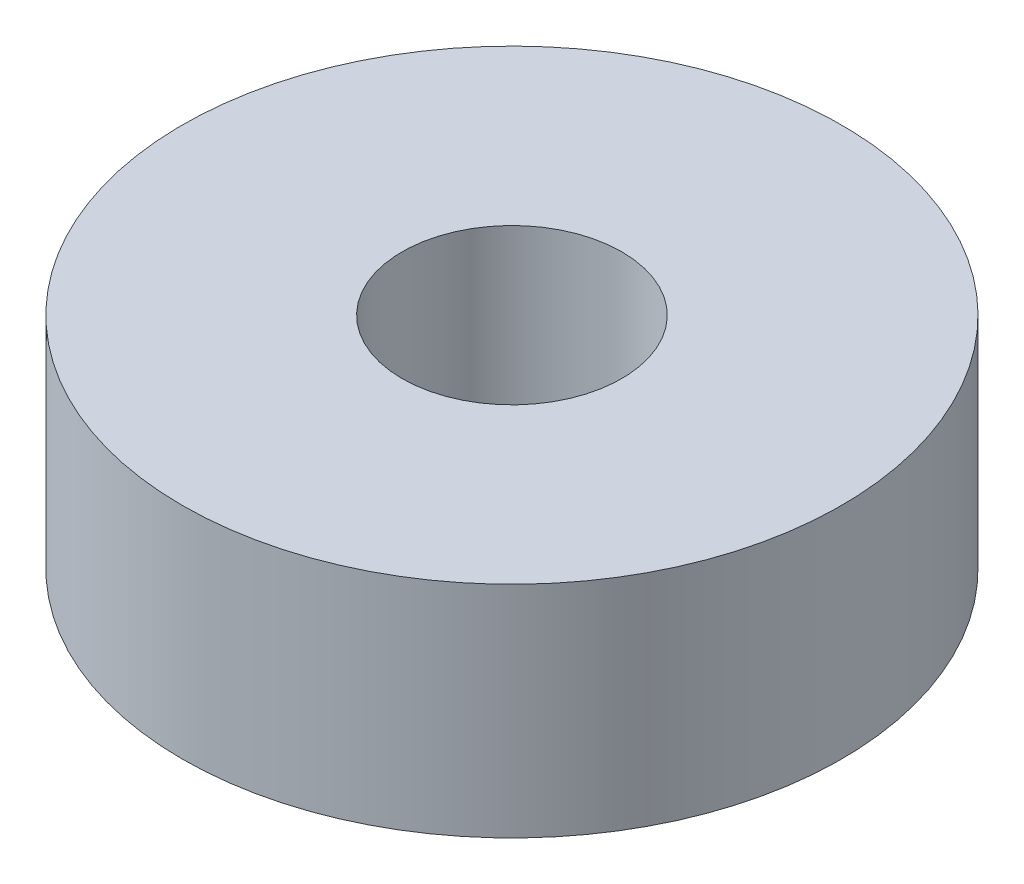
ISO-10303-21;
HEADER;
FILE_DESCRIPTION(('STEP AP214'),'2;1');
FILE_NAME('part.step','',(''),(''),'','','');
FILE_SCHEMA(('AUTOMOTIVE_DESIGN { 1 0 10303 214 1 1 1 1 }'));
ENDSEC;
DATA;
#1=APPLICATION_CONTEXT('core data for automotive mechanical design processes');
#2=APPLICATION_PROTOCOL_DEFINITION('international standard','automotive_design',2000,#1);
#3=PRODUCT_CONTEXT('',#1,'mechanical');
#4=PRODUCT('Part','Part','',(#3));
#5=PRODUCT_RELATED_PRODUCT_CATEGORY('part','',(#4));
#6=PRODUCT_DEFINITION_FORMATION('','',#4);
#7=PRODUCT_DEFINITION_CONTEXT('part definition',#1,'design');
#8=PRODUCT_DEFINITION('design','',#6,#7);
#9=PRODUCT_DEFINITION_SHAPE('','',#8);
#10=(LENGTH_UNIT() NAMED_UNIT(*) SI_UNIT(.MILLI.,.METRE.));
#11=(NAMED_UNIT(*) PLANE_ANGLE_UNIT() SI_UNIT($,.RADIAN.));
#12=(NAMED_UNIT(*) SI_UNIT($,.STERADIAN.) SOLID_ANGLE_UNIT());
#13=UNCERTAINTY_MEASURE_WITH_UNIT(LENGTH_MEASURE(1.E-05),#10,'distance_accuracy_value','');
#14=(GEOMETRIC_REPRESENTATION_CONTEXT(3) GLOBAL_UNCERTAINTY_ASSIGNED_CONTEXT((#13)) GLOBAL_UNIT_ASSIGNED_CONTEXT((#10,
#11,#12)) REPRESENTATION_CONTEXT('',''));
#15=CARTESIAN_POINT('',(0.,0.,0.));
#16=DIRECTION('',(0.,0.,1.));
#17=DIRECTION('',(1.,0.,0.));
#18=AXIS2_PLACEMENT_3D('',#15,#16,#17);
#19=CARTESIAN_POINT('',(0.,3.,0.));
#20=DIRECTION('',(0.,1.,0.));
#21=DIRECTION('',(0.,0.,1.));
#22=AXIS2_PLACEMENT_3D('',#19,#20,#21);
#23=PLANE('',#22);
#24=CARTESIAN_POINT('',(0.,3.,0.));
#25=DIRECTION('',(0.,1.,0.));
#26=DIRECTION('',(0.,0.,1.));
#27=AXIS2_PLACEMENT_3D('',#24,#25,#26);
#28=CIRCLE('',#27,4.5);
#29=CARTESIAN_POINT('',(0.,3.,4.5));
#30=VERTEX_POINT('',#29);
#31=EDGE_CURVE('E10',#30,#30,#28,.T.);
#32=ORIENTED_EDGE('',*,*,#31,.T.);
#33=EDGE_LOOP('',(#32));
#34=FACE_BOUND('',#33,.T.);
#35=CARTESIAN_POINT('',(0.,3.,0.));
#36=DIRECTION('',(0.,1.,0.));
#37=DIRECTION('',(0.,0.,1.));
#38=AXIS2_PLACEMENT_3D('',#35,#36,#37);
#39=CIRCLE('',#38,1.5);
#40=CARTESIAN_POINT('',(0.,3.,1.5));
#41=VERTEX_POINT('',#40);
#42=EDGE_CURVE('E42',#41,#41,#39,.T.);
#43=ORIENTED_EDGE('',*,*,#42,.F.);
#44=EDGE_LOOP('',(#43));
#45=FACE_BOUND('',#44,.T.);
#46=ADVANCED_FACE('F31',(#34,#45),#23,.T.);
#47=CARTESIAN_POINT('',(0.,0.,0.));
#48=DIRECTION('',(0.,1.,0.));
#49=DIRECTION('',(0.,0.,1.));
#50=AXIS2_PLACEMENT_3D('',#47,#48,#49);
#51=PLANE('',#50);
#52=CARTESIAN_POINT('',(0.,0.,0.));
#53=DIRECTION('',(0.,1.,0.));
#54=DIRECTION('',(0.,0.,1.));
#55=AXIS2_PLACEMENT_3D('',#52,#53,#54);
#56=CIRCLE('',#55,4.5);
#57=CARTESIAN_POINT('',(0.,0.,4.5));
#58=VERTEX_POINT('',#57);
#59=EDGE_CURVE('E35',#58,#58,#56,.T.);
#60=ORIENTED_EDGE('',*,*,#59,.F.);
#61=EDGE_LOOP('',(#60));
#62=FACE_BOUND('',#61,.T.);
#63=CARTESIAN_POINT('',(0.,0.,0.));
#64=DIRECTION('',(0.,1.,0.));
#65=DIRECTION('',(0.,0.,1.));
#66=AXIS2_PLACEMENT_3D('',#63,#64,#65);
#67=CIRCLE('',#66,1.5);
#68=CARTESIAN_POINT('',(0.,0.,1.5));
#69=VERTEX_POINT('',#68);
#70=EDGE_CURVE('E44',#69,#69,#67,.T.);
#71=ORIENTED_EDGE('',*,*,#70,.T.);
#72=EDGE_LOOP('',(#71));
#73=FACE_BOUND('',#72,.T.);
#74=ADVANCED_FACE('F54',(#62,#73),#51,.F.);
#75=CARTESIAN_POINT('',(0.,3.,0.));
#76=DIRECTION('',(0.,-1.,0.));
#77=DIRECTION('',(0.,0.,-1.));
#78=AXIS2_PLACEMENT_3D('',#75,#76,#77);
#79=CYLINDRICAL_SURFACE('',#78,4.5);
#80=ORIENTED_EDGE('',*,*,#31,.F.);
#81=EDGE_LOOP('',(#80));
#82=FACE_BOUND('',#81,.T.);
#83=ORIENTED_EDGE('',*,*,#59,.T.);
#84=EDGE_LOOP('',(#83));
#85=FACE_BOUND('',#84,.T.);
#86=ADVANCED_FACE('F33',(#82,#85),#79,.T.);
#87=CARTESIAN_POINT('',(0.,3.,0.));
#88=DIRECTION('',(0.,-1.,0.));
#89=DIRECTION('',(0.,0.,-1.));
#90=AXIS2_PLACEMENT_3D('',#87,#88,#89);
#91=CYLINDRICAL_SURFACE('',#90,1.5);
#92=ORIENTED_EDGE('',*,*,#42,.T.);
#93=EDGE_LOOP('',(#92));
#94=FACE_BOUND('',#93,.T.);
#95=ORIENTED_EDGE('',*,*,#70,.F.);
#96=EDGE_LOOP('',(#95));
#97=FACE_BOUND('',#96,.T.);
#98=ADVANCED_FACE('F50',(#94,#97),#91,.F.);
#99=CLOSED_SHELL('',(#46,#74,#86,#98));
#100=MANIFOLD_SOLID_BREP('B2',#99);
#101=ADVANCED_BREP_SHAPE_REPRESENTATION('',(#18,#100),#14);
#102=SHAPE_DEFINITION_REPRESENTATION(#9,#101);
ENDSEC;
END-ISO-10303-21;
